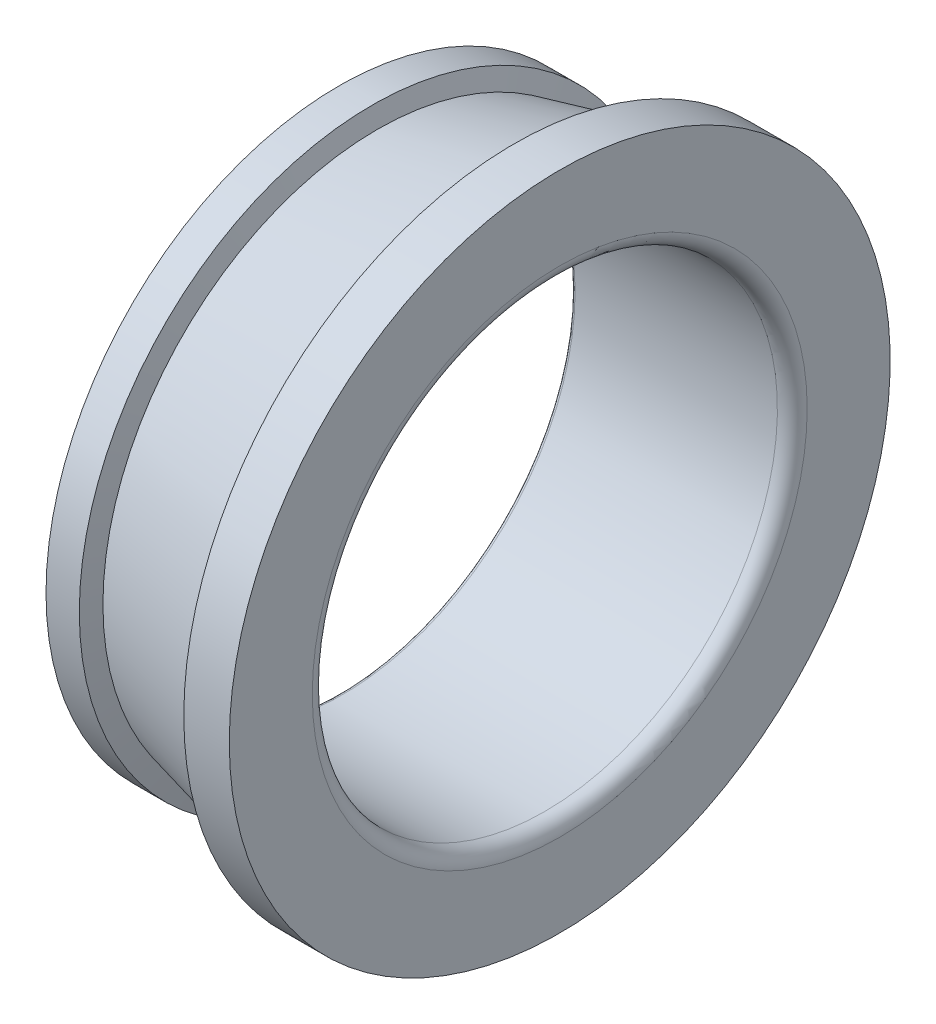
ISO-10303-21;
HEADER;
FILE_DESCRIPTION(('STEP AP214'),'2;1');
FILE_NAME('part.step','',(''),(''),'','','');
FILE_SCHEMA(('AUTOMOTIVE_DESIGN { 1 0 10303 214 1 1 1 1 }'));
ENDSEC;
DATA;
#1=APPLICATION_CONTEXT('core data for automotive mechanical design processes');
#2=APPLICATION_PROTOCOL_DEFINITION('international standard','automotive_design',2000,#1);
#3=PRODUCT_CONTEXT('',#1,'mechanical');
#4=PRODUCT('Part','Part','',(#3));
#5=PRODUCT_RELATED_PRODUCT_CATEGORY('part','',(#4));
#6=PRODUCT_DEFINITION_FORMATION('','',#4);
#7=PRODUCT_DEFINITION_CONTEXT('part definition',#1,'design');
#8=PRODUCT_DEFINITION('design','',#6,#7);
#9=PRODUCT_DEFINITION_SHAPE('','',#8);
#10=(LENGTH_UNIT() NAMED_UNIT(*) SI_UNIT(.MILLI.,.METRE.));
#11=(NAMED_UNIT(*) PLANE_ANGLE_UNIT() SI_UNIT($,.RADIAN.));
#12=(NAMED_UNIT(*) SI_UNIT($,.STERADIAN.) SOLID_ANGLE_UNIT());
#13=UNCERTAINTY_MEASURE_WITH_UNIT(LENGTH_MEASURE(1.E-05),#10,'distance_accuracy_value','');
#14=(GEOMETRIC_REPRESENTATION_CONTEXT(3) GLOBAL_UNCERTAINTY_ASSIGNED_CONTEXT((#13)) GLOBAL_UNIT_ASSIGNED_CONTEXT((#10,
#11,#12)) REPRESENTATION_CONTEXT('',''));
#15=CARTESIAN_POINT('',(0.,0.,0.));
#16=DIRECTION('',(0.,0.,1.));
#17=DIRECTION('',(1.,0.,0.));
#18=AXIS2_PLACEMENT_3D('',#15,#16,#17);
#19=CARTESIAN_POINT('',(1.13635749297916,0.,0.));
#20=DIRECTION('',(-1.,0.,0.));
#21=DIRECTION('',(0.,0.,1.));
#22=AXIS2_PLACEMENT_3D('',#19,#20,#21);
#23=CYLINDRICAL_SURFACE('',#22,19.9866651190464);
#24=CARTESIAN_POINT('',(0.,0.,0.));
#25=DIRECTION('',(-1.,0.,0.));
#26=DIRECTION('',(0.,0.,1.));
#27=AXIS2_PLACEMENT_3D('',#24,#25,#26);
#28=CIRCLE('',#27,19.9866651190464);
#29=CARTESIAN_POINT('',(0.,0.,19.9866651190464));
#30=VERTEX_POINT('',#29);
#31=EDGE_CURVE('E18',#30,#30,#28,.T.);
#32=ORIENTED_EDGE('',*,*,#31,.F.);
#33=EDGE_LOOP('',(#32));
#34=FACE_BOUND('',#33,.T.);
#35=CARTESIAN_POINT('',(2.27271498595831,0.,0.));
#36=DIRECTION('',(-1.,0.,0.));
#37=DIRECTION('',(0.,0.,1.));
#38=AXIS2_PLACEMENT_3D('',#35,#36,#37);
#39=CIRCLE('',#38,19.9866651190464);
#40=CARTESIAN_POINT('',(2.27271498595831,0.,19.9866651190464));
#41=VERTEX_POINT('',#40);
#42=EDGE_CURVE('E30',#41,#41,#39,.F.);
#43=ORIENTED_EDGE('',*,*,#42,.F.);
#44=EDGE_LOOP('',(#43));
#45=FACE_BOUND('',#44,.T.);
#46=ADVANCED_FACE('F14',(#34,#45),#23,.T.);
#47=CARTESIAN_POINT('',(0.,0.,18.0578325595232));
#48=DIRECTION('',(-1.,0.,0.));
#49=DIRECTION('',(0.,0.,1.));
#50=AXIS2_PLACEMENT_3D('',#47,#48,#49);
#51=PLANE('',#50);
#52=CARTESIAN_POINT('',(0.,0.,0.));
#53=DIRECTION('',(-1.,0.,0.));
#54=DIRECTION('',(0.,0.,1.));
#55=AXIS2_PLACEMENT_3D('',#52,#53,#54);
#56=CIRCLE('',#55,16.129);
#57=CARTESIAN_POINT('',(0.,0.,16.129));
#58=VERTEX_POINT('',#57);
#59=EDGE_CURVE('E32',#58,#58,#56,.T.);
#60=ORIENTED_EDGE('',*,*,#59,.F.);
#61=EDGE_LOOP('',(#60));
#62=FACE_BOUND('',#61,.T.);
#63=ORIENTED_EDGE('',*,*,#31,.T.);
#64=EDGE_LOOP('',(#63));
#65=FACE_BOUND('',#64,.T.);
#66=ADVANCED_FACE('F45',(#62,#65),#51,.T.);
#67=CARTESIAN_POINT('',(2.27271498595831,0.,0.));
#68=DIRECTION('',(-1.,0.,0.));
#69=DIRECTION('',(0.,0.,1.));
#70=AXIS2_PLACEMENT_3D('',#67,#68,#69);
#71=CONICAL_SURFACE('',#70,19.9866651190464,1.29864713653142);
#72=ORIENTED_EDGE('',*,*,#42,.T.);
#73=EDGE_LOOP('',(#72));
#74=FACE_BOUND('',#73,.T.);
#75=CARTESIAN_POINT('',(2.62450065985385,0.,0.));
#76=DIRECTION('',(1.,0.,0.));
#77=DIRECTION('',(0.,0.,-1.));
#78=AXIS2_PLACEMENT_3D('',#75,#76,#77);
#79=CIRCLE('',#78,18.7261158531717);
#80=CARTESIAN_POINT('',(2.62450065985385,0.,-18.7261158531717));
#81=VERTEX_POINT('',#80);
#82=EDGE_CURVE('E34',#81,#81,#79,.T.);
#83=ORIENTED_EDGE('',*,*,#82,.F.);
#84=EDGE_LOOP('',(#83));
#85=FACE_BOUND('',#84,.T.);
#86=ADVANCED_FACE('F54',(#74,#85),#71,.T.);
#87=CARTESIAN_POINT('',(0.254,0.,0.));
#88=DIRECTION('',(-1.,0.,0.));
#89=DIRECTION('',(0.,0.,1.));
#90=AXIS2_PLACEMENT_3D('',#87,#88,#89);
#91=TOROIDAL_SURFACE('',#90,16.129,0.253999999999998);
#92=ORIENTED_EDGE('',*,*,#59,.T.);
#93=EDGE_LOOP('',(#92));
#94=FACE_BOUND('',#93,.T.);
#95=CARTESIAN_POINT('',(0.253999999999999,0.,0.));
#96=DIRECTION('',(-1.,0.,0.));
#97=DIRECTION('',(0.,0.,1.));
#98=AXIS2_PLACEMENT_3D('',#95,#96,#97);
#99=CIRCLE('',#98,15.875);
#100=CARTESIAN_POINT('',(0.253999999999999,0.,15.875));
#101=VERTEX_POINT('',#100);
#102=EDGE_CURVE('E38',#101,#101,#99,.F.);
#103=ORIENTED_EDGE('',*,*,#102,.T.);
#104=EDGE_LOOP('',(#103));
#105=FACE_BOUND('',#104,.T.);
#106=ADVANCED_FACE('F79',(#94,#105),#91,.T.);
#107=CARTESIAN_POINT('',(12.3806845642259,0.,0.));
#108=DIRECTION('',(1.,0.,0.));
#109=DIRECTION('',(0.,1.,0.));
#110=AXIS2_PLACEMENT_3D('',#107,#108,#109);
#111=CONICAL_SURFACE('',#110,21.1019202875935,0.238868524991027);
#112=CARTESIAN_POINT('',(12.3806845642259,0.,0.));
#113=DIRECTION('',(-1.,0.,0.));
#114=DIRECTION('',(0.,-1.,0.));
#115=AXIS2_PLACEMENT_3D('',#112,#113,#114);
#116=CIRCLE('',#115,21.1019202875935);
#117=CARTESIAN_POINT('',(12.3806845642259,-21.1019202875935,0.));
#118=VERTEX_POINT('',#117);
#119=EDGE_CURVE('E93',#118,#118,#116,.T.);
#120=ORIENTED_EDGE('',*,*,#119,.T.);
#121=EDGE_LOOP('',(#120));
#122=FACE_BOUND('',#121,.T.);
#123=ORIENTED_EDGE('',*,*,#82,.T.);
#124=EDGE_LOOP('',(#123));
#125=FACE_BOUND('',#124,.T.);
#126=ADVANCED_FACE('F75',(#122,#125),#111,.T.);
#127=CARTESIAN_POINT('',(14.06398,0.,0.));
#128=DIRECTION('',(-1.,0.,0.));
#129=DIRECTION('',(0.,0.,1.));
#130=AXIS2_PLACEMENT_3D('',#127,#128,#129);
#131=CYLINDRICAL_SURFACE('',#130,15.875);
#132=ORIENTED_EDGE('',*,*,#102,.F.);
#133=EDGE_LOOP('',(#132));
#134=FACE_BOUND('',#133,.T.);
#135=CARTESIAN_POINT('',(14.06398,0.,0.));
#136=DIRECTION('',(-1.,0.,0.));
#137=DIRECTION('',(0.,-1.,0.));
#138=AXIS2_PLACEMENT_3D('',#135,#136,#137);
#139=CIRCLE('',#138,15.875);
#140=CARTESIAN_POINT('',(14.06398,-15.875,0.));
#141=VERTEX_POINT('',#140);
#142=EDGE_CURVE('E96',#141,#141,#139,.T.);
#143=ORIENTED_EDGE('',*,*,#142,.F.);
#144=EDGE_LOOP('',(#143));
#145=FACE_BOUND('',#144,.T.);
#146=ADVANCED_FACE('F71',(#134,#145),#131,.F.);
#147=CARTESIAN_POINT('',(11.9748167108874,0.,0.));
#148=DIRECTION('',(-1.,0.,0.));
#149=DIRECTION('',(0.,-1.,0.));
#150=AXIS2_PLACEMENT_3D('',#147,#148,#149);
#151=CONICAL_SURFACE('',#150,22.556261559944,1.29864713653142);
#152=ORIENTED_EDGE('',*,*,#119,.F.);
#153=EDGE_LOOP('',(#152));
#154=FACE_BOUND('',#153,.T.);
#155=CARTESIAN_POINT('',(11.9748167108874,0.,0.));
#156=DIRECTION('',(-1.,0.,0.));
#157=DIRECTION('',(0.,0.,1.));
#158=AXIS2_PLACEMENT_3D('',#155,#156,#157);
#159=CIRCLE('',#158,22.556261559944);
#160=CARTESIAN_POINT('',(11.9748167108874,0.,22.556261559944));
#161=VERTEX_POINT('',#160);
#162=EDGE_CURVE('E27',#161,#161,#159,.F.);
#163=ORIENTED_EDGE('',*,*,#162,.F.);
#164=EDGE_LOOP('',(#163));
#165=FACE_BOUND('',#164,.T.);
#166=ADVANCED_FACE('F68',(#154,#165),#151,.F.);
#167=CARTESIAN_POINT('',(14.06398,0.,0.));
#168=DIRECTION('',(-1.,0.,0.));
#169=DIRECTION('',(0.,0.,1.));
#170=AXIS2_PLACEMENT_3D('',#167,#168,#169);
#171=TOROIDAL_SURFACE('',#170,16.891,1.016);
#172=ORIENTED_EDGE('',*,*,#142,.T.);
#173=EDGE_LOOP('',(#172));
#174=FACE_BOUND('',#173,.T.);
#175=CARTESIAN_POINT('',(15.07998,0.,0.));
#176=DIRECTION('',(-1.,0.,0.));
#177=DIRECTION('',(0.,0.,1.));
#178=AXIS2_PLACEMENT_3D('',#175,#176,#177);
#179=CIRCLE('',#178,16.891);
#180=CARTESIAN_POINT('',(15.07998,0.,16.891));
#181=VERTEX_POINT('',#180);
#182=EDGE_CURVE('E22',#181,#181,#179,.T.);
#183=ORIENTED_EDGE('',*,*,#182,.F.);
#184=EDGE_LOOP('',(#183));
#185=FACE_BOUND('',#184,.T.);
#186=ADVANCED_FACE('F16',(#174,#185),#171,.T.);
#187=CARTESIAN_POINT('',(13.5273983554437,0.,0.));
#188=DIRECTION('',(-1.,0.,0.));
#189=DIRECTION('',(0.,0.,1.));
#190=AXIS2_PLACEMENT_3D('',#187,#188,#189);
#191=CYLINDRICAL_SURFACE('',#190,22.556261559944);
#192=ORIENTED_EDGE('',*,*,#162,.T.);
#193=EDGE_LOOP('',(#192));
#194=FACE_BOUND('',#193,.T.);
#195=CARTESIAN_POINT('',(15.07998,0.,0.));
#196=DIRECTION('',(-1.,0.,0.));
#197=DIRECTION('',(0.,0.,1.));
#198=AXIS2_PLACEMENT_3D('',#195,#196,#197);
#199=CIRCLE('',#198,22.556261559944);
#200=CARTESIAN_POINT('',(15.07998,0.,22.556261559944));
#201=VERTEX_POINT('',#200);
#202=EDGE_CURVE('E9',#201,#201,#199,.F.);
#203=ORIENTED_EDGE('',*,*,#202,.F.);
#204=EDGE_LOOP('',(#203));
#205=FACE_BOUND('',#204,.T.);
#206=ADVANCED_FACE('F59',(#194,#205),#191,.T.);
#207=CARTESIAN_POINT('',(15.07998,0.,19.723630779972));
#208=DIRECTION('',(1.,0.,0.));
#209=DIRECTION('',(0.,0.,-1.));
#210=AXIS2_PLACEMENT_3D('',#207,#208,#209);
#211=PLANE('',#210);
#212=ORIENTED_EDGE('',*,*,#202,.T.);
#213=EDGE_LOOP('',(#212));
#214=FACE_BOUND('',#213,.T.);
#215=ORIENTED_EDGE('',*,*,#182,.T.);
#216=EDGE_LOOP('',(#215));
#217=FACE_BOUND('',#216,.T.);
#218=ADVANCED_FACE('F57',(#214,#217),#211,.T.);
#219=CLOSED_SHELL('',(#46,#66,#86,#106,#126,#146,#166,#186,#206,#218));
#220=MANIFOLD_SOLID_BREP('B1',#219);
#221=ADVANCED_BREP_SHAPE_REPRESENTATION('',(#18,#220),#14);
#222=SHAPE_DEFINITION_REPRESENTATION(#9,#221);
ENDSEC;
END-ISO-10303-21;
